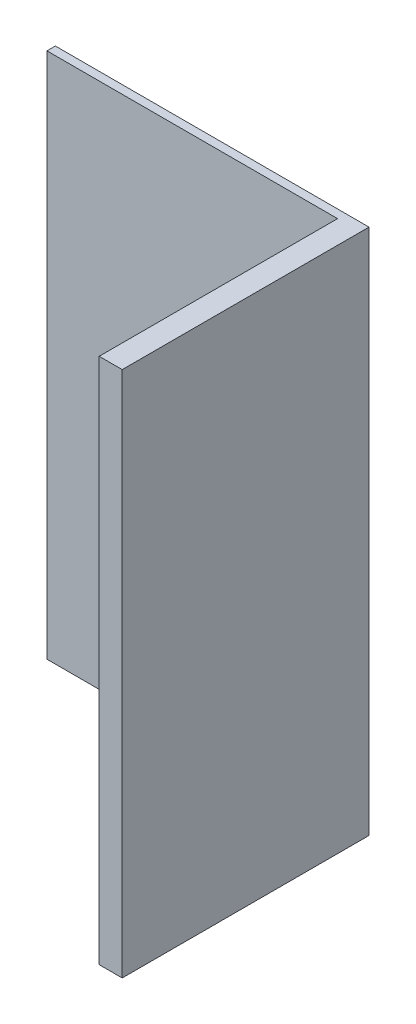
ISO-10303-21;
HEADER;
FILE_DESCRIPTION(('STEP AP214'),'2;1');
FILE_NAME('part.step','',(''),(''),'','','');
FILE_SCHEMA(('AUTOMOTIVE_DESIGN { 1 0 10303 214 1 1 1 1 }'));
ENDSEC;
DATA;
#1=APPLICATION_CONTEXT('core data for automotive mechanical design processes');
#2=APPLICATION_PROTOCOL_DEFINITION('international standard','automotive_design',2000,#1);
#3=PRODUCT_CONTEXT('',#1,'mechanical');
#4=PRODUCT('Part','Part','',(#3));
#5=PRODUCT_RELATED_PRODUCT_CATEGORY('part','',(#4));
#6=PRODUCT_DEFINITION_FORMATION('','',#4);
#7=PRODUCT_DEFINITION_CONTEXT('part definition',#1,'design');
#8=PRODUCT_DEFINITION('design','',#6,#7);
#9=PRODUCT_DEFINITION_SHAPE('','',#8);
#10=(LENGTH_UNIT() NAMED_UNIT(*) SI_UNIT(.MILLI.,.METRE.));
#11=(NAMED_UNIT(*) PLANE_ANGLE_UNIT() SI_UNIT($,.RADIAN.));
#12=(NAMED_UNIT(*) SI_UNIT($,.STERADIAN.) SOLID_ANGLE_UNIT());
#13=UNCERTAINTY_MEASURE_WITH_UNIT(LENGTH_MEASURE(1.E-05),#10,'distance_accuracy_value','');
#14=(GEOMETRIC_REPRESENTATION_CONTEXT(3) GLOBAL_UNCERTAINTY_ASSIGNED_CONTEXT((#13)) GLOBAL_UNIT_ASSIGNED_CONTEXT((#10,
#11,#12)) REPRESENTATION_CONTEXT('',''));
#15=CARTESIAN_POINT('',(0.,0.,0.));
#16=DIRECTION('',(0.,0.,1.));
#17=DIRECTION('',(1.,0.,0.));
#18=AXIS2_PLACEMENT_3D('',#15,#16,#17);
#19=CARTESIAN_POINT('',(3.696,1.6,0.));
#20=DIRECTION('',(0.,1.,0.));
#21=DIRECTION('',(0.,0.,1.));
#22=AXIS2_PLACEMENT_3D('',#19,#20,#21);
#23=PLANE('',#22);
#24=DIRECTION('',(1.,0.,0.));
#25=VECTOR('',#24,1.);
#26=CARTESIAN_POINT('',(1.791,1.6,0.));
#27=LINE('',#26,#25);
#28=CARTESIAN_POINT('',(1.791,1.6,0.));
#29=VERTEX_POINT('',#28);
#30=CARTESIAN_POINT('',(3.696,1.6,0.));
#31=VERTEX_POINT('',#30);
#32=EDGE_CURVE('E11',#29,#31,#27,.T.);
#33=ORIENTED_EDGE('',*,*,#32,.F.);
#34=DIRECTION('',(0.,0.,-1.));
#35=VECTOR('',#34,1.);
#36=CARTESIAN_POINT('',(1.791,1.6,0.051));
#37=LINE('',#36,#35);
#38=CARTESIAN_POINT('',(1.791,1.6,0.051));
#39=VERTEX_POINT('',#38);
#40=EDGE_CURVE('E24',#39,#29,#37,.T.);
#41=ORIENTED_EDGE('',*,*,#40,.F.);
#42=DIRECTION('',(-1.,0.,0.));
#43=VECTOR('',#42,1.);
#44=CARTESIAN_POINT('',(3.556,1.6,0.051));
#45=LINE('',#44,#43);
#46=CARTESIAN_POINT('',(3.556,1.6,0.051));
#47=VERTEX_POINT('',#46);
#48=EDGE_CURVE('E87',#47,#39,#45,.T.);
#49=ORIENTED_EDGE('',*,*,#48,.F.);
#50=DIRECTION('',(0.,0.,-1.));
#51=VECTOR('',#50,1.);
#52=CARTESIAN_POINT('',(3.556,1.6,1.499));
#53=LINE('',#52,#51);
#54=CARTESIAN_POINT('',(3.556,1.6,1.499));
#55=VERTEX_POINT('',#54);
#56=EDGE_CURVE('E114',#55,#47,#53,.T.);
#57=ORIENTED_EDGE('',*,*,#56,.F.);
#58=DIRECTION('',(-1.,0.,0.));
#59=VECTOR('',#58,1.);
#60=CARTESIAN_POINT('',(3.696,1.6,1.499));
#61=LINE('',#60,#59);
#62=CARTESIAN_POINT('',(3.696,1.6,1.499));
#63=VERTEX_POINT('',#62);
#64=EDGE_CURVE('E111',#63,#55,#61,.T.);
#65=ORIENTED_EDGE('',*,*,#64,.F.);
#66=DIRECTION('',(0.,0.,1.));
#67=VECTOR('',#66,1.);
#68=CARTESIAN_POINT('',(3.696,1.6,0.));
#69=LINE('',#68,#67);
#70=EDGE_CURVE('E108',#31,#63,#69,.T.);
#71=ORIENTED_EDGE('',*,*,#70,.F.);
#72=EDGE_LOOP('',(#33,#41,#49,#57,#65,#71));
#73=FACE_BOUND('',#72,.T.);
#74=ADVANCED_FACE('F17',(#73),#23,.T.);
#75=CARTESIAN_POINT('',(1.791,-1.6,0.));
#76=DIRECTION('',(0.,-1.,0.));
#77=DIRECTION('',(0.,0.,1.));
#78=AXIS2_PLACEMENT_3D('',#75,#76,#77);
#79=PLANE('',#78);
#80=DIRECTION('',(-1.,0.,0.));
#81=VECTOR('',#80,1.);
#82=CARTESIAN_POINT('',(3.696,-1.6,0.));
#83=LINE('',#82,#81);
#84=CARTESIAN_POINT('',(3.696,-1.6,0.));
#85=VERTEX_POINT('',#84);
#86=CARTESIAN_POINT('',(1.791,-1.6,0.));
#87=VERTEX_POINT('',#86);
#88=EDGE_CURVE('E106',#85,#87,#83,.T.);
#89=ORIENTED_EDGE('',*,*,#88,.F.);
#90=DIRECTION('',(0.,0.,-1.));
#91=VECTOR('',#90,1.);
#92=CARTESIAN_POINT('',(3.696,-1.6,1.499));
#93=LINE('',#92,#91);
#94=CARTESIAN_POINT('',(3.696,-1.6,1.499));
#95=VERTEX_POINT('',#94);
#96=EDGE_CURVE('E103',#95,#85,#93,.T.);
#97=ORIENTED_EDGE('',*,*,#96,.F.);
#98=DIRECTION('',(1.,0.,0.));
#99=VECTOR('',#98,1.);
#100=CARTESIAN_POINT('',(3.556,-1.6,1.499));
#101=LINE('',#100,#99);
#102=CARTESIAN_POINT('',(3.556,-1.6,1.499));
#103=VERTEX_POINT('',#102);
#104=EDGE_CURVE('E100',#103,#95,#101,.T.);
#105=ORIENTED_EDGE('',*,*,#104,.F.);
#106=DIRECTION('',(0.,0.,1.));
#107=VECTOR('',#106,1.);
#108=CARTESIAN_POINT('',(3.556,-1.6,0.051));
#109=LINE('',#108,#107);
#110=CARTESIAN_POINT('',(3.556,-1.6,0.051));
#111=VERTEX_POINT('',#110);
#112=EDGE_CURVE('E72',#111,#103,#109,.T.);
#113=ORIENTED_EDGE('',*,*,#112,.F.);
#114=DIRECTION('',(1.,0.,0.));
#115=VECTOR('',#114,1.);
#116=CARTESIAN_POINT('',(1.791,-1.6,0.051));
#117=LINE('',#116,#115);
#118=CARTESIAN_POINT('',(1.791,-1.6,0.051));
#119=VERTEX_POINT('',#118);
#120=EDGE_CURVE('E66',#119,#111,#117,.T.);
#121=ORIENTED_EDGE('',*,*,#120,.F.);
#122=DIRECTION('',(0.,0.,1.));
#123=VECTOR('',#122,1.);
#124=CARTESIAN_POINT('',(1.791,-1.6,0.));
#125=LINE('',#124,#123);
#126=EDGE_CURVE('E69',#87,#119,#125,.T.);
#127=ORIENTED_EDGE('',*,*,#126,.F.);
#128=EDGE_LOOP('',(#89,#97,#105,#113,#121,#127));
#129=FACE_BOUND('',#128,.T.);
#130=ADVANCED_FACE('F68',(#129),#79,.T.);
#131=CARTESIAN_POINT('',(3.696,1.6,1.499));
#132=DIRECTION('',(0.,0.,1.));
#133=DIRECTION('',(0.,1.,0.));
#134=AXIS2_PLACEMENT_3D('',#131,#132,#133);
#135=PLANE('',#134);
#136=ORIENTED_EDGE('',*,*,#64,.T.);
#137=DIRECTION('',(0.,1.,0.));
#138=VECTOR('',#137,1.);
#139=CARTESIAN_POINT('',(3.556,-1.6,1.499));
#140=LINE('',#139,#138);
#141=EDGE_CURVE('E83',#103,#55,#140,.T.);
#142=ORIENTED_EDGE('',*,*,#141,.F.);
#143=ORIENTED_EDGE('',*,*,#104,.T.);
#144=DIRECTION('',(0.,-1.,0.));
#145=VECTOR('',#144,1.);
#146=CARTESIAN_POINT('',(3.696,1.6,1.499));
#147=LINE('',#146,#145);
#148=EDGE_CURVE('E88',#63,#95,#147,.T.);
#149=ORIENTED_EDGE('',*,*,#148,.F.);
#150=EDGE_LOOP('',(#136,#142,#143,#149));
#151=FACE_BOUND('',#150,.T.);
#152=ADVANCED_FACE('F125',(#151),#135,.T.);
#153=CARTESIAN_POINT('',(3.556,1.6,0.051));
#154=DIRECTION('',(0.,0.,1.));
#155=DIRECTION('',(0.,1.,0.));
#156=AXIS2_PLACEMENT_3D('',#153,#154,#155);
#157=PLANE('',#156);
#158=ORIENTED_EDGE('',*,*,#48,.T.);
#159=DIRECTION('',(0.,1.,0.));
#160=VECTOR('',#159,1.);
#161=CARTESIAN_POINT('',(1.791,-1.6,0.051));
#162=LINE('',#161,#160);
#163=EDGE_CURVE('E81',#119,#39,#162,.T.);
#164=ORIENTED_EDGE('',*,*,#163,.F.);
#165=ORIENTED_EDGE('',*,*,#120,.T.);
#166=DIRECTION('',(0.,-1.,0.));
#167=VECTOR('',#166,1.);
#168=CARTESIAN_POINT('',(3.556,1.6,0.051));
#169=LINE('',#168,#167);
#170=EDGE_CURVE('E89',#47,#111,#169,.T.);
#171=ORIENTED_EDGE('',*,*,#170,.F.);
#172=EDGE_LOOP('',(#158,#164,#165,#171));
#173=FACE_BOUND('',#172,.T.);
#174=ADVANCED_FACE('F86',(#173),#157,.T.);
#175=CARTESIAN_POINT('',(3.696,-1.6,0.));
#176=DIRECTION('',(1.,0.,0.));
#177=DIRECTION('',(0.,0.,1.));
#178=AXIS2_PLACEMENT_3D('',#175,#176,#177);
#179=PLANE('',#178);
#180=DIRECTION('',(0.,-1.,0.));
#181=VECTOR('',#180,1.);
#182=CARTESIAN_POINT('',(3.696,1.6,0.));
#183=LINE('',#182,#181);
#184=EDGE_CURVE('E93',#31,#85,#183,.T.);
#185=ORIENTED_EDGE('',*,*,#184,.F.);
#186=ORIENTED_EDGE('',*,*,#70,.T.);
#187=ORIENTED_EDGE('',*,*,#148,.T.);
#188=ORIENTED_EDGE('',*,*,#96,.T.);
#189=EDGE_LOOP('',(#185,#186,#187,#188));
#190=FACE_BOUND('',#189,.T.);
#191=ADVANCED_FACE('F121',(#190),#179,.T.);
#192=CARTESIAN_POINT('',(1.791,1.6,0.));
#193=DIRECTION('',(-1.,0.,0.));
#194=DIRECTION('',(0.,0.,1.));
#195=AXIS2_PLACEMENT_3D('',#192,#193,#194);
#196=PLANE('',#195);
#197=DIRECTION('',(0.,1.,0.));
#198=VECTOR('',#197,1.);
#199=CARTESIAN_POINT('',(1.791,-1.6,0.));
#200=LINE('',#199,#198);
#201=EDGE_CURVE('E82',#87,#29,#200,.T.);
#202=ORIENTED_EDGE('',*,*,#201,.F.);
#203=ORIENTED_EDGE('',*,*,#126,.T.);
#204=ORIENTED_EDGE('',*,*,#163,.T.);
#205=ORIENTED_EDGE('',*,*,#40,.T.);
#206=EDGE_LOOP('',(#202,#203,#204,#205));
#207=FACE_BOUND('',#206,.T.);
#208=ADVANCED_FACE('F80',(#207),#196,.T.);
#209=CARTESIAN_POINT('',(3.556,1.6,0.051));
#210=DIRECTION('',(-1.,0.,0.));
#211=DIRECTION('',(0.,0.,1.));
#212=AXIS2_PLACEMENT_3D('',#209,#210,#211);
#213=PLANE('',#212);
#214=ORIENTED_EDGE('',*,*,#170,.T.);
#215=ORIENTED_EDGE('',*,*,#112,.T.);
#216=ORIENTED_EDGE('',*,*,#141,.T.);
#217=ORIENTED_EDGE('',*,*,#56,.T.);
#218=EDGE_LOOP('',(#214,#215,#216,#217));
#219=FACE_BOUND('',#218,.T.);
#220=ADVANCED_FACE('F127',(#219),#213,.T.);
#221=CARTESIAN_POINT('',(3.696,-1.6,0.));
#222=DIRECTION('',(0.,0.,-1.));
#223=DIRECTION('',(0.,1.,0.));
#224=AXIS2_PLACEMENT_3D('',#221,#222,#223);
#225=PLANE('',#224);
#226=ORIENTED_EDGE('',*,*,#88,.T.);
#227=ORIENTED_EDGE('',*,*,#201,.T.);
#228=ORIENTED_EDGE('',*,*,#32,.T.);
#229=ORIENTED_EDGE('',*,*,#184,.T.);
#230=EDGE_LOOP('',(#226,#227,#228,#229));
#231=FACE_BOUND('',#230,.T.);
#232=ADVANCED_FACE('F117',(#231),#225,.T.);
#233=CLOSED_SHELL('',(#74,#130,#152,#174,#191,#208,#220,#232));
#234=MANIFOLD_SOLID_BREP('B1',#233);
#235=ADVANCED_BREP_SHAPE_REPRESENTATION('',(#18,#234),#14);
#236=SHAPE_DEFINITION_REPRESENTATION(#9,#235);
ENDSEC;
END-ISO-10303-21;
